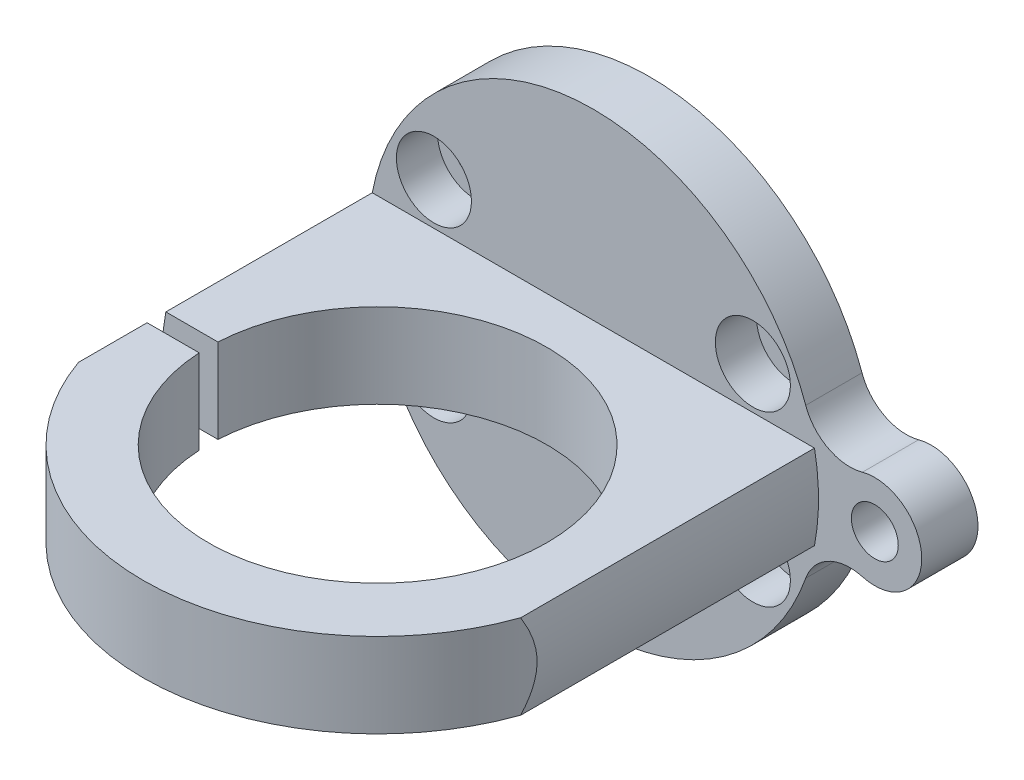
ISO-10303-21;
HEADER;
FILE_DESCRIPTION(('STEP AP214'),'2;1');
FILE_NAME('part.step','',(''),(''),'','','');
FILE_SCHEMA(('AUTOMOTIVE_DESIGN { 1 0 10303 214 1 1 1 1 }'));
ENDSEC;
DATA;
#1=APPLICATION_CONTEXT('core data for automotive mechanical design processes');
#2=APPLICATION_PROTOCOL_DEFINITION('international standard','automotive_design',2000,#1);
#3=PRODUCT_CONTEXT('',#1,'mechanical');
#4=PRODUCT('Part','Part','',(#3));
#5=PRODUCT_RELATED_PRODUCT_CATEGORY('part','',(#4));
#6=PRODUCT_DEFINITION_FORMATION('','',#4);
#7=PRODUCT_DEFINITION_CONTEXT('part definition',#1,'design');
#8=PRODUCT_DEFINITION('design','',#6,#7);
#9=PRODUCT_DEFINITION_SHAPE('','',#8);
#10=(LENGTH_UNIT() NAMED_UNIT(*) SI_UNIT(.MILLI.,.METRE.));
#11=(NAMED_UNIT(*) PLANE_ANGLE_UNIT() SI_UNIT($,.RADIAN.));
#12=(NAMED_UNIT(*) SI_UNIT($,.STERADIAN.) SOLID_ANGLE_UNIT());
#13=UNCERTAINTY_MEASURE_WITH_UNIT(LENGTH_MEASURE(1.E-05),#10,'distance_accuracy_value','');
#14=(GEOMETRIC_REPRESENTATION_CONTEXT(3) GLOBAL_UNCERTAINTY_ASSIGNED_CONTEXT((#13)) GLOBAL_UNIT_ASSIGNED_CONTEXT((#10,
#11,#12)) REPRESENTATION_CONTEXT('',''));
#15=CARTESIAN_POINT('',(0.,0.,0.));
#16=DIRECTION('',(0.,0.,1.));
#17=DIRECTION('',(1.,0.,0.));
#18=AXIS2_PLACEMENT_3D('',#15,#16,#17);
#19=CARTESIAN_POINT('',(0.,0.,-6.));
#20=DIRECTION('',(0.,0.,1.));
#21=DIRECTION('',(1.,0.,0.));
#22=AXIS2_PLACEMENT_3D('',#19,#20,#21);
#23=CYLINDRICAL_SURFACE('',#22,24.);
#24=DIRECTION('',(0.,0.,1.));
#25=VECTOR('',#24,1.);
#26=CARTESIAN_POINT('',(23.5743504682526,-4.5,-6.));
#27=LINE('',#26,#25);
#28=CARTESIAN_POINT('',(23.5743504682526,-4.5,31.3216584885466));
#29=VERTEX_POINT('',#28);
#30=CARTESIAN_POINT('',(23.5743504682526,-4.5,0.));
#31=VERTEX_POINT('',#30);
#32=EDGE_CURVE('E218',#29,#31,#27,.F.);
#33=ORIENTED_EDGE('',*,*,#32,.T.);
#34=CARTESIAN_POINT('',(0.,0.,0.));
#35=DIRECTION('',(0.,0.,1.));
#36=DIRECTION('',(-1.,0.,0.));
#37=AXIS2_PLACEMENT_3D('',#34,#35,#36);
#38=CIRCLE('',#37,24.);
#39=CARTESIAN_POINT('',(23.5743504682526,4.5,0.));
#40=VERTEX_POINT('',#39);
#41=EDGE_CURVE('E160',#31,#40,#38,.T.);
#42=ORIENTED_EDGE('',*,*,#41,.T.);
#43=DIRECTION('',(0.,0.,1.));
#44=VECTOR('',#43,1.);
#45=CARTESIAN_POINT('',(23.5743504682526,4.5,-6.));
#46=LINE('',#45,#44);
#47=CARTESIAN_POINT('',(23.5743504682526,4.5,31.3216584885466));
#48=VERTEX_POINT('',#47);
#49=EDGE_CURVE('E217',#48,#40,#46,.F.);
#50=ORIENTED_EDGE('',*,*,#49,.F.);
#51=CARTESIAN_POINT('',(23.5743504682526,4.5,31.3216584885466));
#52=CARTESIAN_POINT('',(23.6157573192222,4.28301573047034,31.2044104124574));
#53=CARTESIAN_POINT('',(23.6546469507852,4.06307747692704,31.0913980349118));
#54=CARTESIAN_POINT('',(23.7270788362601,3.6162494982413,30.8764465440462));
#55=CARTESIAN_POINT('',(23.7606058100089,3.3893420306107,30.7745393273754));
#56=CARTESIAN_POINT('',(23.8221387533765,2.92591145786183,30.5839248774555));
#57=CARTESIAN_POINT('',(23.8500717825218,2.68930443477932,30.4953953221107));
#58=CARTESIAN_POINT('',(23.8992990807367,2.20942829175013,30.3369201471838));
#59=CARTESIAN_POINT('',(23.9206002093363,1.96616634046176,30.2669553367951));
#60=CARTESIAN_POINT('',(23.9521526056305,1.52702529743059,30.1621717967941));
#61=CARTESIAN_POINT('',(23.9637975166772,1.33228309402099,30.1230239325422));
#62=CARTESIAN_POINT('',(23.9823829053702,0.940112768312964,30.0601979514931));
#63=CARTESIAN_POINT('',(23.9893247646182,0.742685452212207,30.0365152916022));
#64=CARTESIAN_POINT('',(23.9982882648339,0.347726186835377,30.0058846337755));
#65=CARTESIAN_POINT('',(24.0003422165771,0.150203606678098,29.9988267434912));
#66=CARTESIAN_POINT('',(23.9995647437288,-0.244711817262284,30.0014922486172));
#67=CARTESIAN_POINT('',(23.9967334300783,-0.442104663889715,30.0112152629441));
#68=CARTESIAN_POINT('',(23.9862803764371,-0.834761147924739,30.0468922230931));
#69=CARTESIAN_POINT('',(23.9786709585535,-1.03002895178623,30.0728044182715));
#70=CARTESIAN_POINT('',(23.9588737736743,-1.4177874423982,30.1395776867656));
#71=CARTESIAN_POINT('',(23.9466839545981,-1.61027684418988,30.1804454601649));
#72=CARTESIAN_POINT('',(23.9034802076835,-2.18431462097293,30.3234951807389));
#73=CARTESIAN_POINT('',(23.8658903015328,-2.56040118760636,30.4459095987706));
#74=CARTESIAN_POINT('',(23.7872793809115,-3.20017617811185,30.6926830116748));
#75=CARTESIAN_POINT('',(23.7496461115302,-3.46782812056137,30.8083908153243));
#76=CARTESIAN_POINT('',(23.6672030505266,-3.99155750688383,31.0548499962851));
#77=CARTESIAN_POINT('',(23.6224722181626,-4.24772656697199,31.1854318507251));
#78=CARTESIAN_POINT('',(23.5743504682526,-4.5,31.3216584885466));
#79=B_SPLINE_CURVE_WITH_KNOTS('',3,(#51,#52,#53,#54,#55,#56,#57,#58,#59,#60,#61,#62,#63,#64,#65,
#66,#67,#68,#69,#70,#71,#72,#73,#74,#75,#76,#77,#78),.UNSPECIFIED.,.F.,.F.,(4,2,2,2,2,2,2,2,2,2,
2,2,2,4),(0.,0.750439495083586,1.50298057284552,2.26477314161382,3.02577513253489,
3.62211160634237,4.2182728200918,4.81048211830474,5.40267796800572,5.99335285900303,
6.58429269634364,7.77223830948735,8.65367393881817,9.5259146224551),.UNSPECIFIED.);
#80=EDGE_CURVE('E210',#48,#29,#79,.T.);
#81=ORIENTED_EDGE('',*,*,#80,.T.);
#82=EDGE_LOOP('',(#33,#42,#50,#81));
#83=FACE_BOUND('',#82,.T.);
#84=ADVANCED_FACE('F35',(#83),#23,.T.);
#85=CARTESIAN_POINT('',(0.,0.,-6.));
#86=DIRECTION('',(0.,0.,1.));
#87=DIRECTION('',(1.,0.,0.));
#88=AXIS2_PLACEMENT_3D('',#85,#86,#87);
#89=PLANE('',#88);
#90=CARTESIAN_POINT('',(30.,0.,-6.));
#91=DIRECTION('',(0.,0.,1.));
#92=DIRECTION('',(1.,0.,0.));
#93=AXIS2_PLACEMENT_3D('',#90,#91,#92);
#94=CIRCLE('',#93,2.5);
#95=CARTESIAN_POINT('',(32.5,0.,-6.));
#96=VERTEX_POINT('',#95);
#97=EDGE_CURVE('E169',#96,#96,#94,.T.);
#98=ORIENTED_EDGE('',*,*,#97,.T.);
#99=EDGE_LOOP('',(#98));
#100=FACE_BOUND('',#99,.T.);
#101=CARTESIAN_POINT('',(17.,9.,-6.));
#102=DIRECTION('',(0.,0.,1.));
#103=DIRECTION('',(1.,0.,0.));
#104=AXIS2_PLACEMENT_3D('',#101,#102,#103);
#105=CIRCLE('',#104,2.25);
#106=CARTESIAN_POINT('',(19.25,9.,-6.));
#107=VERTEX_POINT('',#106);
#108=EDGE_CURVE('E248',#107,#107,#105,.T.);
#109=ORIENTED_EDGE('',*,*,#108,.T.);
#110=EDGE_LOOP('',(#109));
#111=FACE_BOUND('',#110,.T.);
#112=CARTESIAN_POINT('',(-17.,-9.,-6.));
#113=DIRECTION('',(0.,0.,1.));
#114=DIRECTION('',(1.,0.,0.));
#115=AXIS2_PLACEMENT_3D('',#112,#113,#114);
#116=CIRCLE('',#115,2.25);
#117=CARTESIAN_POINT('',(-14.75,-9.,-6.));
#118=VERTEX_POINT('',#117);
#119=EDGE_CURVE('E260',#118,#118,#116,.T.);
#120=ORIENTED_EDGE('',*,*,#119,.T.);
#121=EDGE_LOOP('',(#120));
#122=FACE_BOUND('',#121,.T.);
#123=CARTESIAN_POINT('',(-17.,9.,-6.));
#124=DIRECTION('',(0.,0.,1.));
#125=DIRECTION('',(1.,0.,0.));
#126=AXIS2_PLACEMENT_3D('',#123,#124,#125);
#127=CIRCLE('',#126,2.25);
#128=CARTESIAN_POINT('',(-14.75,9.,-6.));
#129=VERTEX_POINT('',#128);
#130=EDGE_CURVE('E272',#129,#129,#127,.T.);
#131=ORIENTED_EDGE('',*,*,#130,.T.);
#132=EDGE_LOOP('',(#131));
#133=FACE_BOUND('',#132,.T.);
#134=CARTESIAN_POINT('',(17.,-9.,-6.));
#135=DIRECTION('',(0.,0.,1.));
#136=DIRECTION('',(1.,0.,0.));
#137=AXIS2_PLACEMENT_3D('',#134,#135,#136);
#138=CIRCLE('',#137,2.25);
#139=CARTESIAN_POINT('',(19.25,-9.,-6.));
#140=VERTEX_POINT('',#139);
#141=EDGE_CURVE('E284',#140,#140,#138,.T.);
#142=ORIENTED_EDGE('',*,*,#141,.T.);
#143=EDGE_LOOP('',(#142));
#144=FACE_BOUND('',#143,.T.);
#145=CARTESIAN_POINT('',(0.,0.,-6.));
#146=DIRECTION('',(0.,0.,1.));
#147=DIRECTION('',(1.,0.,0.));
#148=AXIS2_PLACEMENT_3D('',#145,#146,#147);
#149=CIRCLE('',#148,24.);
#150=CARTESIAN_POINT('',(22.6344827586207,7.97998685773998,-6.));
#151=VERTEX_POINT('',#150);
#152=CARTESIAN_POINT('',(22.6344827586207,-7.97998685773998,-6.));
#153=VERTEX_POINT('',#152);
#154=EDGE_CURVE('E314',#151,#153,#149,.T.);
#155=ORIENTED_EDGE('',*,*,#154,.F.);
#156=CARTESIAN_POINT('',(27.35,9.64248411976914,-6.));
#157=DIRECTION('',(0.,0.,1.));
#158=DIRECTION('',(1.,0.,0.));
#159=AXIS2_PLACEMENT_3D('',#156,#157,#158);
#160=CIRCLE('',#159,5.);
#161=CARTESIAN_POINT('',(28.675,4.82124205988457,-6.));
#162=VERTEX_POINT('',#161);
#163=EDGE_CURVE('E167',#151,#162,#160,.T.);
#164=ORIENTED_EDGE('',*,*,#163,.T.);
#165=CARTESIAN_POINT('',(30.,0.,-6.));
#166=DIRECTION('',(0.,0.,-1.));
#167=DIRECTION('',(-1.,0.,0.));
#168=AXIS2_PLACEMENT_3D('',#165,#166,#167);
#169=CIRCLE('',#168,5.);
#170=CARTESIAN_POINT('',(28.675,-4.82124205988457,-6.));
#171=VERTEX_POINT('',#170);
#172=EDGE_CURVE('E145',#162,#171,#169,.T.);
#173=ORIENTED_EDGE('',*,*,#172,.T.);
#174=CARTESIAN_POINT('',(27.35,-9.64248411976914,-6.));
#175=DIRECTION('',(0.,0.,1.));
#176=DIRECTION('',(-1.,0.,0.));
#177=AXIS2_PLACEMENT_3D('',#174,#175,#176);
#178=CIRCLE('',#177,5.);
#179=EDGE_CURVE('E162',#171,#153,#178,.T.);
#180=ORIENTED_EDGE('',*,*,#179,.T.);
#181=EDGE_LOOP('',(#155,#164,#173,#180));
#182=FACE_BOUND('',#181,.T.);
#183=ADVANCED_FACE('F337',(#100,#111,#122,#133,#144,#182),#89,.F.);
#184=CARTESIAN_POINT('',(0.,4.5,24.));
#185=DIRECTION('',(0.,0.,-1.));
#186=DIRECTION('',(-1.,0.,0.));
#187=AXIS2_PLACEMENT_3D('',#184,#185,#186);
#188=PLANE('',#187);
#189=CARTESIAN_POINT('',(-21.5,0.,24.));
#190=DIRECTION('',(0.,0.,-1.));
#191=DIRECTION('',(-1.,0.,0.));
#192=AXIS2_PLACEMENT_3D('',#189,#190,#191);
#193=CIRCLE('',#192,1.69999999999999);
#194=CARTESIAN_POINT('',(-23.2,0.,24.));
#195=VERTEX_POINT('',#194);
#196=EDGE_CURVE('E238',#195,#195,#193,.T.);
#197=ORIENTED_EDGE('',*,*,#196,.F.);
#198=EDGE_LOOP('',(#197));
#199=FACE_BOUND('',#198,.T.);
#200=DIRECTION('',(1.,0.,0.));
#201=VECTOR('',#200,1.);
#202=CARTESIAN_POINT('',(0.,-4.5,24.));
#203=LINE('',#202,#201);
#204=CARTESIAN_POINT('',(-23.5743504682526,-4.5,24.));
#205=VERTEX_POINT('',#204);
#206=CARTESIAN_POINT('',(-18.0222778804456,-4.5,24.));
#207=VERTEX_POINT('',#206);
#208=EDGE_CURVE('E287',#205,#207,#203,.T.);
#209=ORIENTED_EDGE('',*,*,#208,.F.);
#210=CARTESIAN_POINT('',(0.,0.,24.));
#211=DIRECTION('',(0.,0.,-1.));
#212=DIRECTION('',(-1.,0.,0.));
#213=AXIS2_PLACEMENT_3D('',#210,#211,#212);
#214=CIRCLE('',#213,24.);
#215=CARTESIAN_POINT('',(-23.5743504682526,4.5,24.));
#216=VERTEX_POINT('',#215);
#217=EDGE_CURVE('E340',#205,#216,#214,.T.);
#218=ORIENTED_EDGE('',*,*,#217,.T.);
#219=DIRECTION('',(1.,0.,0.));
#220=VECTOR('',#219,1.);
#221=CARTESIAN_POINT('',(0.,4.5,24.));
#222=LINE('',#221,#220);
#223=CARTESIAN_POINT('',(-18.0222778804456,4.5,24.));
#224=VERTEX_POINT('',#223);
#225=EDGE_CURVE('E297',#216,#224,#222,.T.);
#226=ORIENTED_EDGE('',*,*,#225,.T.);
#227=DIRECTION('',(0.,-1.,0.));
#228=VECTOR('',#227,1.);
#229=CARTESIAN_POINT('',(-18.0222778804456,4.5,24.));
#230=LINE('',#229,#228);
#231=EDGE_CURVE('E307',#224,#207,#230,.T.);
#232=ORIENTED_EDGE('',*,*,#231,.T.);
#233=EDGE_LOOP('',(#209,#218,#226,#232));
#234=FACE_BOUND('',#233,.T.);
#235=ADVANCED_FACE('F194',(#199,#234),#188,.T.);
#236=CARTESIAN_POINT('',(0.,4.5,23.));
#237=DIRECTION('',(0.,-1.,0.));
#238=DIRECTION('',(0.,0.,-1.));
#239=AXIS2_PLACEMENT_3D('',#236,#237,#238);
#240=CYLINDRICAL_SURFACE('',#239,25.);
#241=ORIENTED_EDGE('',*,*,#80,.F.);
#242=CARTESIAN_POINT('',(0.,4.5,23.));
#243=DIRECTION('',(0.,1.,0.));
#244=DIRECTION('',(0.,0.,1.));
#245=AXIS2_PLACEMENT_3D('',#242,#243,#244);
#246=CIRCLE('',#245,25.);
#247=CARTESIAN_POINT('',(-23.5743504682526,4.5,31.3216584885466));
#248=VERTEX_POINT('',#247);
#249=EDGE_CURVE('E299',#248,#48,#246,.T.);
#250=ORIENTED_EDGE('',*,*,#249,.F.);
#251=CARTESIAN_POINT('',(-23.5743504682526,-4.5,31.3216584885466));
#252=CARTESIAN_POINT('',(-23.6157573192222,-4.28301573047034,31.2044104124574));
#253=CARTESIAN_POINT('',(-23.6546469507852,-4.06307747692704,31.0913980349118));
#254=CARTESIAN_POINT('',(-23.7270788362601,-3.6162494982413,30.8764465440462));
#255=CARTESIAN_POINT('',(-23.7606058100089,-3.3893420306107,30.7745393273754));
#256=CARTESIAN_POINT('',(-23.8221387533765,-2.92591145786183,30.5839248774555));
#257=CARTESIAN_POINT('',(-23.8500717825218,-2.68930443477932,30.4953953221107));
#258=CARTESIAN_POINT('',(-23.8992990807367,-2.20942829175013,30.3369201471838));
#259=CARTESIAN_POINT('',(-23.9206002093363,-1.96616634046176,30.2669553367951));
#260=CARTESIAN_POINT('',(-23.9521526056305,-1.52702529743059,30.1621717967941));
#261=CARTESIAN_POINT('',(-23.9637975166772,-1.33228309402099,30.1230239325422));
#262=CARTESIAN_POINT('',(-23.9823829053702,-0.940112768312964,30.0601979514931));
#263=CARTESIAN_POINT('',(-23.9893247646182,-0.742685452212207,30.0365152916022));
#264=CARTESIAN_POINT('',(-23.9982882648339,-0.347726186835377,30.0058846337755));
#265=CARTESIAN_POINT('',(-24.0003422165771,-0.150203606678098,29.9988267434912));
#266=CARTESIAN_POINT('',(-23.9995647437288,0.244711817262284,30.0014922486172));
#267=CARTESIAN_POINT('',(-23.9967334300783,0.442104663889715,30.0112152629441));
#268=CARTESIAN_POINT('',(-23.9862803764371,0.834761147924739,30.0468922230931));
#269=CARTESIAN_POINT('',(-23.9786709585535,1.03002895178623,30.0728044182715));
#270=CARTESIAN_POINT('',(-23.9588737736743,1.4177874423982,30.1395776867656));
#271=CARTESIAN_POINT('',(-23.9466839545981,1.61027684418988,30.1804454601649));
#272=CARTESIAN_POINT('',(-23.9034802076835,2.18431462097293,30.3234951807389));
#273=CARTESIAN_POINT('',(-23.8658903015328,2.56040118760636,30.4459095987706));
#274=CARTESIAN_POINT('',(-23.7872793809115,3.20017617811185,30.6926830116748));
#275=CARTESIAN_POINT('',(-23.7496461115302,3.46782812056137,30.8083908153243));
#276=CARTESIAN_POINT('',(-23.6672030505266,3.99155750688383,31.0548499962851));
#277=CARTESIAN_POINT('',(-23.6224722181626,4.24772656697199,31.1854318507251));
#278=CARTESIAN_POINT('',(-23.5743504682526,4.5,31.3216584885466));
#279=B_SPLINE_CURVE_WITH_KNOTS('',3,(#251,#252,#253,#254,#255,#256,#257,#258,#259,#260,#261,
#262,#263,#264,#265,#266,#267,#268,#269,#270,#271,#272,#273,#274,#275,#276,#277,#278),
.UNSPECIFIED.,.F.,.F.,(4,2,2,2,2,2,2,2,2,2,2,2,2,4),(0.,0.750439495083586,1.50298057284552,
2.26477314161382,3.02577513253489,3.62211160634237,4.2182728200918,4.81048211830474,
5.40267796800572,5.99335285900303,6.58429269634364,7.77223830948735,8.65367393881817,
9.5259146224551),.UNSPECIFIED.);
#280=CARTESIAN_POINT('',(-23.8997093023256,2.1917790181339,30.335113854899));
#281=VERTEX_POINT('',#280);
#282=EDGE_CURVE('E186',#281,#248,#279,.T.);
#283=ORIENTED_EDGE('',*,*,#282,.F.);
#284=CARTESIAN_POINT('',(-24.3647286050963,1.53487133634801,28.6));
#285=CARTESIAN_POINT('',(-24.3385334363902,1.58373798265813,28.7139775703707));
#286=CARTESIAN_POINT('',(-24.3114208287813,1.63136154234516,28.8282706371185));
#287=CARTESIAN_POINT('',(-24.2553668314557,1.72436120298112,29.0573145974324));
#288=CARTESIAN_POINT('',(-24.2264255470778,1.76973743311678,29.1720654642713));
#289=CARTESIAN_POINT('',(-24.1667192479999,1.85848378673641,29.4018574256571));
#290=CARTESIAN_POINT('',(-24.1359543539079,1.90185404255247,29.5168985005297));
#291=CARTESIAN_POINT('',(-24.0725976603706,1.98671714979433,29.7471699811742));
#292=CARTESIAN_POINT('',(-24.0400058270598,2.02820996639259,29.8624003904173));
#293=CARTESIAN_POINT('',(-23.9393100191523,2.15021375507858,30.2088397530666));
#294=CARTESIAN_POINT('',(-23.8684386531629,2.22802365182075,30.4402071163822));
#295=CARTESIAN_POINT('',(-23.7192892753877,2.37662100906926,30.9028092297959));
#296=CARTESIAN_POINT('',(-23.6410110560834,2.44740827270812,31.1340439759957));
#297=CARTESIAN_POINT('',(-23.4766649904604,2.5819797772045,31.5969035437314));
#298=CARTESIAN_POINT('',(-23.3905674025857,2.64573504711592,31.8285262592054));
#299=CARTESIAN_POINT('',(-23.2107968478142,2.76538087649977,32.2908790842952));
#300=CARTESIAN_POINT('',(-23.1171236246241,2.82127116971447,32.5216091634351));
#301=CARTESIAN_POINT('',(-22.9222892745375,2.92433317144847,32.9815305834762));
#302=CARTESIAN_POINT('',(-22.821137047292,2.97151501598587,33.2107234102247));
#303=CARTESIAN_POINT('',(-22.6112750435608,3.05620191689344,33.6673974729581));
#304=CARTESIAN_POINT('',(-22.5025667300751,3.0937088399212,33.8948790308764));
#305=CARTESIAN_POINT('',(-22.2927129469009,3.15346785906082,34.3173712534795));
#306=CARTESIAN_POINT('',(-22.1925030920029,3.17708991961985,34.5126522286489));
#307=CARTESIAN_POINT('',(-21.986579255437,3.21507441060415,34.9012044152304));
#308=CARTESIAN_POINT('',(-21.8808656745912,3.22943751431862,35.0944757717714));
#309=CARTESIAN_POINT('',(-21.6639482278379,3.24768976941905,35.478867149361));
#310=CARTESIAN_POINT('',(-21.552735448731,3.25156130884696,35.6699830172825));
#311=CARTESIAN_POINT('',(-21.3253237949323,3.24729477918506,36.0491156352255));
#312=CARTESIAN_POINT('',(-21.2091250542498,3.23915703267695,36.2371324683531));
#313=CARTESIAN_POINT('',(-20.9706323710269,3.20888181418307,36.6118539648462));
#314=CARTESIAN_POINT('',(-20.8482762034527,3.18655154658656,36.7985041706439));
#315=CARTESIAN_POINT('',(-20.5998218237209,3.12546875389362,37.1667451562976));
#316=CARTESIAN_POINT('',(-20.4737221190001,3.08670959448353,37.3483338606121));
#317=CARTESIAN_POINT('',(-20.219847768322,2.99032755726669,37.7039185686807));
#318=CARTESIAN_POINT('',(-20.0920844824312,2.93279886855754,37.8779476659678));
#319=CARTESIAN_POINT('',(-19.8365587552973,2.79579324959464,38.2169597016321));
#320=CARTESIAN_POINT('',(-19.7087965386287,2.71634559253682,38.381954355899));
#321=CARTESIAN_POINT('',(-19.4707375805368,2.54239559939889,38.6819254867493));
#322=CARTESIAN_POINT('',(-19.3601003054575,2.45061373289908,38.8181861350708));
#323=CARTESIAN_POINT('',(-19.1447290497027,2.24443056248103,39.0781791172158));
#324=CARTESIAN_POINT('',(-19.0400001864018,2.13001002593505,39.2019006623855));
#325=CARTESIAN_POINT('',(-18.8402006813346,1.8746945239978,39.4338218573584));
#326=CARTESIAN_POINT('',(-18.7452734361951,1.73347446134265,39.541798600837));
#327=CARTESIAN_POINT('',(-18.6170173774416,1.50287830073305,39.6856482064051));
#328=CARTESIAN_POINT('',(-18.5766455355931,1.42295054418319,39.7305525833018));
#329=CARTESIAN_POINT('',(-18.5015965299608,1.25712090476786,39.8135074774243));
#330=CARTESIAN_POINT('',(-18.4669159121219,1.17122269083133,39.8515621531637));
#331=CARTESIAN_POINT('',(-18.3942550179231,0.965520323854969,39.9308935091991));
#332=CARTESIAN_POINT('',(-18.3587822838977,0.843675800458655,39.9692908576954));
#333=CARTESIAN_POINT('',(-18.3019791685359,0.593006022268458,40.0305410496288));
#334=CARTESIAN_POINT('',(-18.2806393433245,0.464185491365228,40.0534042735246));
#335=CARTESIAN_POINT('',(-18.2536441101458,0.202530080266468,40.0822974575331));
#336=CARTESIAN_POINT('',(-18.2480455110572,0.0696824045964489,40.0882664481666));
#337=CARTESIAN_POINT('',(-18.2531690358145,-0.195331257372771,40.0827934798375));
#338=CARTESIAN_POINT('',(-18.2638911262661,-0.327497245066233,40.0713515564998));
#339=CARTESIAN_POINT('',(-18.2997857819516,-0.580132104902831,40.0328642597361));
#340=CARTESIAN_POINT('',(-18.3241618952024,-0.700849601779827,40.0066785041519));
#341=CARTESIAN_POINT('',(-18.3851161235766,-0.935248491520648,39.9407648066543));
#342=CARTESIAN_POINT('',(-18.4216981858215,-1.04892759421413,39.9010324840036));
#343=CARTESIAN_POINT('',(-18.5185059703771,-1.30272916467186,39.7949863923354));
#344=CARTESIAN_POINT('',(-18.5825520222421,-1.43954007428014,39.7242321919334));
#345=CARTESIAN_POINT('',(-18.7236124047489,-1.69578077295666,39.5661582525348));
#346=CARTESIAN_POINT('',(-18.8006497915181,-1.81517894395756,39.4788090263122));
#347=CARTESIAN_POINT('',(-18.9953384875816,-2.07983857709831,39.2544388639999));
#348=CARTESIAN_POINT('',(-19.1170799216749,-2.21691640392302,39.1113620720405));
#349=CARTESIAN_POINT('',(-19.3690111733188,-2.4601154277705,38.8076102312752));
#350=CARTESIAN_POINT('',(-19.4992153608496,-2.56618219489933,38.646904912899));
#351=CARTESIAN_POINT('',(-19.7335849742352,-2.730937026152,38.34969951951));
#352=CARTESIAN_POINT('',(-19.8372004770122,-2.79491417987831,38.2156175401911));
#353=CARTESIAN_POINT('',(-20.0445365991255,-2.90828109538358,37.941422231395));
#354=CARTESIAN_POINT('',(-20.1482572448508,-2.95766269223846,37.8013055760706));
#355=CARTESIAN_POINT('',(-20.3546270658332,-3.04353829165821,37.516203912168));
#356=CARTESIAN_POINT('',(-20.4572748279482,-3.08001697477782,37.3712133389154));
#357=CARTESIAN_POINT('',(-20.6605532356314,-3.14151248328639,37.0774107993677));
#358=CARTESIAN_POINT('',(-20.7611831588867,-3.1665252719486,36.9285975066736));
#359=CARTESIAN_POINT('',(-21.028557998876,-3.22019759688432,36.5237790991229));
#360=CARTESIAN_POINT('',(-21.1928507388584,-3.23939631071066,36.2648797746961));
#361=CARTESIAN_POINT('',(-21.5120712122413,-3.25390246186473,35.7406896555651));
#362=CARTESIAN_POINT('',(-21.6669925796892,-3.2491938393868,35.4753946836683));
#363=CARTESIAN_POINT('',(-21.9671387732237,-3.21979972896844,34.9389982614785));
#364=CARTESIAN_POINT('',(-22.112318111876,-3.19502675241949,34.667876454317));
#365=CARTESIAN_POINT('',(-22.3917540168518,-3.12856139434019,34.1221995428851));
#366=CARTESIAN_POINT('',(-22.526012031066,-3.086871259999,33.8476448993079));
#367=CARTESIAN_POINT('',(-22.7510189197817,-3.00134194138837,33.3654720794811));
#368=CARTESIAN_POINT('',(-22.8442094432717,-2.96068867437376,33.1584115686668));
#369=CARTESIAN_POINT('',(-23.024388493418,-2.87207618281287,32.743139208142));
#370=CARTESIAN_POINT('',(-23.1113765268117,-2.82411637815202,32.534927268278));
#371=CARTESIAN_POINT('',(-23.2792010830456,-2.7215110412464,32.1175339378097));
#372=CARTESIAN_POINT('',(-23.3600339983459,-2.66686163638435,31.9083520537561));
#373=CARTESIAN_POINT('',(-23.5155247712785,-2.55137985140135,31.4894061361882));
#374=CARTESIAN_POINT('',(-23.5901826653635,-2.49054750778444,31.279642106118));
#375=CARTESIAN_POINT('',(-23.7321613905875,-2.3640734265739,30.8633367699531));
#376=CARTESIAN_POINT('',(-23.7995843907902,-2.29852962468513,30.6568005083532));
#377=CARTESIAN_POINT('',(-23.9285360851068,-2.1618377105549,30.2437537041032));
#378=CARTESIAN_POINT('',(-23.9900650030512,-2.09068981131872,30.037243160774));
#379=CARTESIAN_POINT('',(-24.1071806583825,-1.94268181233978,29.6249294307223));
#380=CARTESIAN_POINT('',(-24.1627757554613,-1.86583001442275,29.419125655013));
#381=CARTESIAN_POINT('',(-24.241792273872,-1.7456720180906,29.1111980682059));
#382=CARTESIAN_POINT('',(-24.2674032519795,-1.70480320842436,29.0086787079431));
#383=CARTESIAN_POINT('',(-24.3171633892363,-1.62124781990399,28.8040214190092));
#384=CARTESIAN_POINT('',(-24.3413124792158,-1.57856115519978,28.7018835086008));
#385=CARTESIAN_POINT('',(-24.3647286050963,-1.53487133634801,28.6));
#386=B_SPLINE_CURVE_WITH_KNOTS('',3,(#284,#285,#286,#287,#288,#289,#290,#291,#292,#293,#294,
#295,#296,#297,#298,#299,#300,#301,#302,#303,#304,#305,#306,#307,#308,#309,#310,#311,#312,#313,
#314,#315,#316,#317,#318,#319,#320,#321,#322,#323,#324,#325,#326,#327,#328,#329,#330,#331,#332,
#333,#334,#335,#336,#337,#338,#339,#340,#341,#342,#343,#344,#345,#346,#347,#348,#349,#350,#351,
#352,#353,#354,#355,#356,#357,#358,#359,#360,#361,#362,#363,#364,#365,#366,#367,#368,#369,#370,
#371,#372,#373,#374,#375,#376,#377,#378,#379,#380,#381,#382,#383,#384,#385),.UNSPECIFIED.,.F.,
.F.,(4,2,2,2,2,2,2,2,2,2,2,2,2,2,2,2,2,2,2,2,2,2,2,2,2,2,2,2,2,2,2,2,2,2,2,2,2,2,2,2,2,2,2,2,2,
2,2,2,2,2,4),(0.,0.38022499631615,0.760428110139757,1.14060610646842,1.52079115241887,
2.28310961627768,3.04544944439374,3.81082112981607,4.57621871959162,5.34071974407243,
6.1050731569332,6.76710712814685,7.42909295240097,8.09218935131156,8.75526793909981,
9.42755232962323,10.100108460999,10.7693401919576,11.4376824420786,12.0304043876406,
12.6236320577199,13.2245784220342,13.5246129919435,13.8244647892915,14.2204615448881,
14.6161934203134,15.0133516398425,15.4105090467383,15.7866054295484,16.1628235512944,
16.6605019664194,17.1590731057889,17.8528988804507,18.5479352303284,19.0905863590734,
19.6335404810961,20.1771370978864,20.7209249486776,21.6411306934085,22.5619546701194,
23.4868155635096,24.4115536432807,25.1033828725627,25.7952670594179,26.4875536900422,
27.1798362336454,27.8604916059669,28.5411211198357,29.2207787270052,29.5606508669504,
29.900539075547),.UNSPECIFIED.);
#387=CARTESIAN_POINT('',(-23.8997093023256,-2.1917790181339,30.335113854899));
#388=VERTEX_POINT('',#387);
#389=EDGE_CURVE('E201',#281,#388,#386,.T.);
#390=ORIENTED_EDGE('',*,*,#389,.T.);
#391=CARTESIAN_POINT('',(-23.5743504682526,-4.5,31.3216584885466));
#392=VERTEX_POINT('',#391);
#393=EDGE_CURVE('E59',#392,#388,#279,.T.);
#394=ORIENTED_EDGE('',*,*,#393,.F.);
#395=CARTESIAN_POINT('',(0.,-4.5,23.));
#396=DIRECTION('',(0.,1.,0.));
#397=DIRECTION('',(0.,0.,1.));
#398=AXIS2_PLACEMENT_3D('',#395,#396,#397);
#399=CIRCLE('',#398,25.);
#400=EDGE_CURVE('E289',#392,#29,#399,.T.);
#401=ORIENTED_EDGE('',*,*,#400,.T.);
#402=EDGE_LOOP('',(#241,#250,#283,#390,#394,#401));
#403=FACE_BOUND('',#402,.T.);
#404=ADVANCED_FACE('F188',(#403),#240,.T.);
#405=CARTESIAN_POINT('',(0.,4.5,22.));
#406=DIRECTION('',(0.,0.,-1.));
#407=DIRECTION('',(-1.,0.,0.));
#408=AXIS2_PLACEMENT_3D('',#405,#406,#407);
#409=PLANE('',#408);
#410=CARTESIAN_POINT('',(-21.5,0.,22.));
#411=DIRECTION('',(0.,0.,1.));
#412=DIRECTION('',(1.,0.,0.));
#413=AXIS2_PLACEMENT_3D('',#410,#411,#412);
#414=CIRCLE('',#413,1.25);
#415=CARTESIAN_POINT('',(-20.25,0.,22.));
#416=VERTEX_POINT('',#415);
#417=EDGE_CURVE('E226',#416,#416,#414,.T.);
#418=ORIENTED_EDGE('',*,*,#417,.F.);
#419=EDGE_LOOP('',(#418));
#420=FACE_BOUND('',#419,.T.);
#421=CARTESIAN_POINT('',(0.,0.,22.));
#422=DIRECTION('',(0.,0.,-1.));
#423=DIRECTION('',(-1.,0.,0.));
#424=AXIS2_PLACEMENT_3D('',#421,#422,#423);
#425=CIRCLE('',#424,24.);
#426=CARTESIAN_POINT('',(-23.5743504682526,-4.5,22.));
#427=VERTEX_POINT('',#426);
#428=CARTESIAN_POINT('',(-23.5743504682526,4.5,22.));
#429=VERTEX_POINT('',#428);
#430=EDGE_CURVE('E223',#427,#429,#425,.T.);
#431=ORIENTED_EDGE('',*,*,#430,.F.);
#432=DIRECTION('',(1.,0.,0.));
#433=VECTOR('',#432,1.);
#434=CARTESIAN_POINT('',(0.,-4.5,22.));
#435=LINE('',#434,#433);
#436=CARTESIAN_POINT('',(-18.0222778804456,-4.5,22.));
#437=VERTEX_POINT('',#436);
#438=EDGE_CURVE('E292',#427,#437,#435,.T.);
#439=ORIENTED_EDGE('',*,*,#438,.T.);
#440=DIRECTION('',(0.,-1.,0.));
#441=VECTOR('',#440,1.);
#442=CARTESIAN_POINT('',(-18.0222778804456,4.5,22.));
#443=LINE('',#442,#441);
#444=CARTESIAN_POINT('',(-18.0222778804456,4.5,22.));
#445=VERTEX_POINT('',#444);
#446=EDGE_CURVE('E310',#445,#437,#443,.T.);
#447=ORIENTED_EDGE('',*,*,#446,.F.);
#448=DIRECTION('',(1.,0.,0.));
#449=VECTOR('',#448,1.);
#450=CARTESIAN_POINT('',(0.,4.5,22.));
#451=LINE('',#450,#449);
#452=EDGE_CURVE('E302',#429,#445,#451,.T.);
#453=ORIENTED_EDGE('',*,*,#452,.F.);
#454=EDGE_LOOP('',(#431,#439,#447,#453));
#455=FACE_BOUND('',#454,.T.);
#456=ADVANCED_FACE('F193',(#420,#455),#409,.F.);
#457=CARTESIAN_POINT('',(0.,4.5,0.));
#458=DIRECTION('',(0.,1.,0.));
#459=DIRECTION('',(0.,0.,1.));
#460=AXIS2_PLACEMENT_3D('',#457,#458,#459);
#461=PLANE('',#460);
#462=DIRECTION('',(-1.,0.,0.));
#463=VECTOR('',#462,1.);
#464=CARTESIAN_POINT('',(0.,4.5,0.));
#465=LINE('',#464,#463);
#466=CARTESIAN_POINT('',(-23.5743504682526,4.5,0.));
#467=VERTEX_POINT('',#466);
#468=EDGE_CURVE('E321',#40,#467,#465,.T.);
#469=ORIENTED_EDGE('',*,*,#468,.T.);
#470=DIRECTION('',(0.,0.,1.));
#471=VECTOR('',#470,1.);
#472=CARTESIAN_POINT('',(-23.5743504682526,4.5,-6.));
#473=LINE('',#472,#471);
#474=EDGE_CURVE('E222',#467,#429,#473,.T.);
#475=ORIENTED_EDGE('',*,*,#474,.T.);
#476=ORIENTED_EDGE('',*,*,#452,.T.);
#477=CARTESIAN_POINT('',(0.,4.5,23.));
#478=DIRECTION('',(0.,1.,0.));
#479=DIRECTION('',(0.,0.,1.));
#480=AXIS2_PLACEMENT_3D('',#477,#478,#479);
#481=CIRCLE('',#480,18.05);
#482=EDGE_CURVE('E304',#224,#445,#481,.T.);
#483=ORIENTED_EDGE('',*,*,#482,.F.);
#484=ORIENTED_EDGE('',*,*,#225,.F.);
#485=EDGE_CURVE('E361',#216,#248,#473,.T.);
#486=ORIENTED_EDGE('',*,*,#485,.T.);
#487=ORIENTED_EDGE('',*,*,#249,.T.);
#488=ORIENTED_EDGE('',*,*,#49,.T.);
#489=EDGE_LOOP('',(#469,#475,#476,#483,#484,#486,#487,#488));
#490=FACE_BOUND('',#489,.T.);
#491=ADVANCED_FACE('F360',(#490),#461,.T.);
#492=CARTESIAN_POINT('',(0.,-4.5,0.));
#493=DIRECTION('',(0.,1.,0.));
#494=DIRECTION('',(0.,0.,1.));
#495=AXIS2_PLACEMENT_3D('',#492,#493,#494);
#496=PLANE('',#495);
#497=DIRECTION('',(0.,0.,1.));
#498=VECTOR('',#497,1.);
#499=CARTESIAN_POINT('',(-23.5743504682526,-4.5,-6.));
#500=LINE('',#499,#498);
#501=CARTESIAN_POINT('',(-23.5743504682526,-4.5,0.));
#502=VERTEX_POINT('',#501);
#503=EDGE_CURVE('E225',#502,#427,#500,.T.);
#504=ORIENTED_EDGE('',*,*,#503,.F.);
#505=DIRECTION('',(-1.,0.,0.));
#506=VECTOR('',#505,1.);
#507=CARTESIAN_POINT('',(0.,-4.5,0.));
#508=LINE('',#507,#506);
#509=EDGE_CURVE('E317',#31,#502,#508,.T.);
#510=ORIENTED_EDGE('',*,*,#509,.F.);
#511=ORIENTED_EDGE('',*,*,#32,.F.);
#512=ORIENTED_EDGE('',*,*,#400,.F.);
#513=EDGE_CURVE('E185',#205,#392,#500,.T.);
#514=ORIENTED_EDGE('',*,*,#513,.F.);
#515=ORIENTED_EDGE('',*,*,#208,.T.);
#516=CARTESIAN_POINT('',(0.,-4.5,23.));
#517=DIRECTION('',(0.,1.,0.));
#518=DIRECTION('',(0.,0.,1.));
#519=AXIS2_PLACEMENT_3D('',#516,#517,#518);
#520=CIRCLE('',#519,18.05);
#521=EDGE_CURVE('E294',#207,#437,#520,.T.);
#522=ORIENTED_EDGE('',*,*,#521,.T.);
#523=ORIENTED_EDGE('',*,*,#438,.F.);
#524=EDGE_LOOP('',(#504,#510,#511,#512,#514,#515,#522,#523));
#525=FACE_BOUND('',#524,.T.);
#526=ADVANCED_FACE('F346',(#525),#496,.F.);
#527=CARTESIAN_POINT('',(-19.8,0.,28.6));
#528=DIRECTION('',(0.,0.,-1.));
#529=DIRECTION('',(-1.,0.,0.));
#530=AXIS2_PLACEMENT_3D('',#527,#528,#529);
#531=PLANE('',#530);
#532=CARTESIAN_POINT('',(-21.5,0.,28.6));
#533=DIRECTION('',(0.,0.,1.));
#534=DIRECTION('',(1.,0.,0.));
#535=AXIS2_PLACEMENT_3D('',#532,#533,#534);
#536=CIRCLE('',#535,1.7);
#537=CARTESIAN_POINT('',(-19.8,0.,28.6));
#538=VERTEX_POINT('',#537);
#539=EDGE_CURVE('E235',#538,#538,#536,.T.);
#540=ORIENTED_EDGE('',*,*,#539,.F.);
#541=EDGE_LOOP('',(#540));
#542=FACE_BOUND('',#541,.T.);
#543=CARTESIAN_POINT('',(0.,0.,28.6));
#544=DIRECTION('',(0.,0.,-1.));
#545=DIRECTION('',(-1.,0.,0.));
#546=AXIS2_PLACEMENT_3D('',#543,#544,#545);
#547=CIRCLE('',#546,24.);
#548=CARTESIAN_POINT('',(-23.8997093023256,-2.1917790181339,28.6));
#549=VERTEX_POINT('',#548);
#550=CARTESIAN_POINT('',(-23.8997093023256,2.1917790181339,28.6));
#551=VERTEX_POINT('',#550);
#552=EDGE_CURVE('E175',#549,#551,#547,.T.);
#553=ORIENTED_EDGE('',*,*,#552,.F.);
#554=CARTESIAN_POINT('',(-21.5,0.,28.6));
#555=DIRECTION('',(0.,0.,1.));
#556=DIRECTION('',(1.,0.,0.));
#557=AXIS2_PLACEMENT_3D('',#554,#555,#556);
#558=CIRCLE('',#557,3.25);
#559=EDGE_CURVE('E232',#549,#551,#558,.T.);
#560=ORIENTED_EDGE('',*,*,#559,.T.);
#561=EDGE_LOOP('',(#553,#560));
#562=FACE_BOUND('',#561,.T.);
#563=ADVANCED_FACE('F395',(#542,#562),#531,.F.);
#564=CARTESIAN_POINT('',(-21.5,0.,44.));
#565=DIRECTION('',(0.,0.,1.));
#566=DIRECTION('',(1.,0.,0.));
#567=AXIS2_PLACEMENT_3D('',#564,#565,#566);
#568=CYLINDRICAL_SURFACE('',#567,3.25);
#569=DIRECTION('',(0.,0.,1.));
#570=VECTOR('',#569,1.);
#571=CARTESIAN_POINT('',(-23.8997093023256,2.1917790181339,21.));
#572=LINE('',#571,#570);
#573=EDGE_CURVE('E12',#551,#281,#572,.T.);
#574=ORIENTED_EDGE('',*,*,#573,.F.);
#575=ORIENTED_EDGE('',*,*,#559,.F.);
#576=DIRECTION('',(0.,0.,1.));
#577=VECTOR('',#576,1.);
#578=CARTESIAN_POINT('',(-23.8997093023256,-2.1917790181339,21.));
#579=LINE('',#578,#577);
#580=EDGE_CURVE('E44',#388,#549,#579,.F.);
#581=ORIENTED_EDGE('',*,*,#580,.F.);
#582=ORIENTED_EDGE('',*,*,#389,.F.);
#583=EDGE_LOOP('',(#574,#575,#581,#582));
#584=FACE_BOUND('',#583,.T.);
#585=ADVANCED_FACE('F388',(#584),#568,.F.);
#586=DIRECTION('',(0.,0.,-1.));
#587=VECTOR('',#586,1.);
#588=CARTESIAN_POINT('',(22.6344827586207,-7.97998685773998,0.));
#589=LINE('',#588,#587);
#590=CARTESIAN_POINT('',(22.6344827586207,-7.97998685773998,0.));
#591=VERTEX_POINT('',#590);
#592=EDGE_CURVE('E173',#591,#153,#589,.T.);
#593=ORIENTED_EDGE('',*,*,#592,.F.);
#594=CARTESIAN_POINT('',(0.,0.,0.));
#595=DIRECTION('',(0.,0.,1.));
#596=DIRECTION('',(1.,0.,0.));
#597=AXIS2_PLACEMENT_3D('',#594,#595,#596);
#598=CIRCLE('',#597,24.);
#599=EDGE_CURVE('E313',#502,#591,#598,.T.);
#600=ORIENTED_EDGE('',*,*,#599,.F.);
#601=ORIENTED_EDGE('',*,*,#503,.T.);
#602=ORIENTED_EDGE('',*,*,#430,.T.);
#603=ORIENTED_EDGE('',*,*,#474,.F.);
#604=CARTESIAN_POINT('',(22.6344827586207,7.97998685773998,0.));
#605=VERTEX_POINT('',#604);
#606=EDGE_CURVE('E318',#605,#467,#598,.T.);
#607=ORIENTED_EDGE('',*,*,#606,.F.);
#608=DIRECTION('',(0.,0.,-1.));
#609=VECTOR('',#608,1.);
#610=CARTESIAN_POINT('',(22.6344827586207,7.97998685773998,0.));
#611=LINE('',#610,#609);
#612=EDGE_CURVE('E149',#605,#151,#611,.T.);
#613=ORIENTED_EDGE('',*,*,#612,.T.);
#614=ORIENTED_EDGE('',*,*,#154,.T.);
#615=EDGE_LOOP('',(#593,#600,#601,#602,#603,#607,#613,#614));
#616=FACE_BOUND('',#615,.T.);
#617=ADVANCED_FACE('F37',(#616),#23,.T.);
#618=CARTESIAN_POINT('',(0.,0.,0.));
#619=DIRECTION('',(0.,0.,1.));
#620=DIRECTION('',(1.,0.,0.));
#621=AXIS2_PLACEMENT_3D('',#618,#619,#620);
#622=PLANE('',#621);
#623=CARTESIAN_POINT('',(30.,0.,0.));
#624=DIRECTION('',(0.,0.,1.));
#625=DIRECTION('',(1.,0.,0.));
#626=AXIS2_PLACEMENT_3D('',#623,#624,#625);
#627=CIRCLE('',#626,2.5);
#628=CARTESIAN_POINT('',(32.5,0.,0.));
#629=VERTEX_POINT('',#628);
#630=EDGE_CURVE('E612',#629,#629,#627,.T.);
#631=ORIENTED_EDGE('',*,*,#630,.F.);
#632=EDGE_LOOP('',(#631));
#633=FACE_BOUND('',#632,.T.);
#634=CARTESIAN_POINT('',(17.,9.,0.));
#635=DIRECTION('',(0.,0.,1.));
#636=DIRECTION('',(1.,0.,0.));
#637=AXIS2_PLACEMENT_3D('',#634,#635,#636);
#638=CIRCLE('',#637,4.);
#639=CARTESIAN_POINT('',(21.,9.,0.));
#640=VERTEX_POINT('',#639);
#641=EDGE_CURVE('E239',#640,#640,#638,.T.);
#642=ORIENTED_EDGE('',*,*,#641,.F.);
#643=EDGE_LOOP('',(#642));
#644=FACE_BOUND('',#643,.T.);
#645=CARTESIAN_POINT('',(-17.,9.,0.));
#646=DIRECTION('',(0.,0.,1.));
#647=DIRECTION('',(1.,0.,0.));
#648=AXIS2_PLACEMENT_3D('',#645,#646,#647);
#649=CIRCLE('',#648,4.);
#650=CARTESIAN_POINT('',(-13.,9.,0.));
#651=VERTEX_POINT('',#650);
#652=EDGE_CURVE('E263',#651,#651,#649,.T.);
#653=ORIENTED_EDGE('',*,*,#652,.F.);
#654=EDGE_LOOP('',(#653));
#655=FACE_BOUND('',#654,.T.);
#656=ORIENTED_EDGE('',*,*,#468,.F.);
#657=ORIENTED_EDGE('',*,*,#41,.F.);
#658=ORIENTED_EDGE('',*,*,#509,.T.);
#659=ORIENTED_EDGE('',*,*,#599,.T.);
#660=CARTESIAN_POINT('',(27.35,-9.64248411976914,0.));
#661=DIRECTION('',(0.,0.,1.));
#662=DIRECTION('',(-1.,0.,0.));
#663=AXIS2_PLACEMENT_3D('',#660,#661,#662);
#664=CIRCLE('',#663,5.);
#665=CARTESIAN_POINT('',(28.675,-4.82124205988457,0.));
#666=VERTEX_POINT('',#665);
#667=EDGE_CURVE('E155',#666,#591,#664,.T.);
#668=ORIENTED_EDGE('',*,*,#667,.F.);
#669=CARTESIAN_POINT('',(30.,0.,0.));
#670=DIRECTION('',(0.,0.,-1.));
#671=DIRECTION('',(-1.,0.,0.));
#672=AXIS2_PLACEMENT_3D('',#669,#670,#671);
#673=CIRCLE('',#672,5.);
#674=CARTESIAN_POINT('',(28.675,4.82124205988457,0.));
#675=VERTEX_POINT('',#674);
#676=EDGE_CURVE('E142',#675,#666,#673,.T.);
#677=ORIENTED_EDGE('',*,*,#676,.F.);
#678=CARTESIAN_POINT('',(27.35,9.64248411976914,0.));
#679=DIRECTION('',(0.,0.,1.));
#680=DIRECTION('',(1.,0.,0.));
#681=AXIS2_PLACEMENT_3D('',#678,#679,#680);
#682=CIRCLE('',#681,5.);
#683=EDGE_CURVE('E51',#605,#675,#682,.T.);
#684=ORIENTED_EDGE('',*,*,#683,.F.);
#685=ORIENTED_EDGE('',*,*,#606,.T.);
#686=EDGE_LOOP('',(#656,#657,#658,#659,#668,#677,#684,#685));
#687=FACE_BOUND('',#686,.T.);
#688=CARTESIAN_POINT('',(-17.,-9.,0.));
#689=DIRECTION('',(0.,0.,1.));
#690=DIRECTION('',(1.,0.,0.));
#691=AXIS2_PLACEMENT_3D('',#688,#689,#690);
#692=CIRCLE('',#691,4.);
#693=CARTESIAN_POINT('',(-13.,-9.,0.));
#694=VERTEX_POINT('',#693);
#695=EDGE_CURVE('E251',#694,#694,#692,.T.);
#696=ORIENTED_EDGE('',*,*,#695,.F.);
#697=EDGE_LOOP('',(#696));
#698=FACE_BOUND('',#697,.T.);
#699=CARTESIAN_POINT('',(17.,-9.,0.));
#700=DIRECTION('',(0.,0.,1.));
#701=DIRECTION('',(1.,0.,0.));
#702=AXIS2_PLACEMENT_3D('',#699,#700,#701);
#703=CIRCLE('',#702,4.);
#704=CARTESIAN_POINT('',(21.,-9.,0.));
#705=VERTEX_POINT('',#704);
#706=EDGE_CURVE('E275',#705,#705,#703,.T.);
#707=ORIENTED_EDGE('',*,*,#706,.F.);
#708=EDGE_LOOP('',(#707));
#709=FACE_BOUND('',#708,.T.);
#710=ADVANCED_FACE('F152',(#633,#644,#655,#687,#698,#709),#622,.T.);
#711=CARTESIAN_POINT('',(0.,4.5,23.));
#712=DIRECTION('',(0.,-1.,0.));
#713=DIRECTION('',(0.,0.,-1.));
#714=AXIS2_PLACEMENT_3D('',#711,#712,#713);
#715=CYLINDRICAL_SURFACE('',#714,18.05);
#716=ORIENTED_EDGE('',*,*,#446,.T.);
#717=ORIENTED_EDGE('',*,*,#521,.F.);
#718=ORIENTED_EDGE('',*,*,#231,.F.);
#719=ORIENTED_EDGE('',*,*,#482,.T.);
#720=EDGE_LOOP('',(#716,#717,#718,#719));
#721=FACE_BOUND('',#720,.T.);
#722=ADVANCED_FACE('F393',(#721),#715,.F.);
#723=CARTESIAN_POINT('',(17.,-9.,0.));
#724=DIRECTION('',(0.,0.,1.));
#725=DIRECTION('',(1.,0.,0.));
#726=AXIS2_PLACEMENT_3D('',#723,#724,#725);
#727=CYLINDRICAL_SURFACE('',#726,2.25);
#728=ORIENTED_EDGE('',*,*,#141,.F.);
#729=EDGE_LOOP('',(#728));
#730=FACE_BOUND('',#729,.T.);
#731=CARTESIAN_POINT('',(17.,-9.,-4.4));
#732=DIRECTION('',(0.,0.,1.));
#733=DIRECTION('',(1.,0.,0.));
#734=AXIS2_PLACEMENT_3D('',#731,#732,#733);
#735=CIRCLE('',#734,2.25);
#736=CARTESIAN_POINT('',(19.25,-9.,-4.4));
#737=VERTEX_POINT('',#736);
#738=EDGE_CURVE('E281',#737,#737,#735,.T.);
#739=ORIENTED_EDGE('',*,*,#738,.T.);
#740=EDGE_LOOP('',(#739));
#741=FACE_BOUND('',#740,.T.);
#742=ADVANCED_FACE('F453',(#730,#741),#727,.F.);
#743=CARTESIAN_POINT('',(19.25,-9.,-4.4));
#744=DIRECTION('',(0.,0.,-1.));
#745=DIRECTION('',(-1.,0.,0.));
#746=AXIS2_PLACEMENT_3D('',#743,#744,#745);
#747=PLANE('',#746);
#748=ORIENTED_EDGE('',*,*,#738,.F.);
#749=EDGE_LOOP('',(#748));
#750=FACE_BOUND('',#749,.T.);
#751=CARTESIAN_POINT('',(17.,-9.,-4.4));
#752=DIRECTION('',(0.,0.,1.));
#753=DIRECTION('',(1.,0.,0.));
#754=AXIS2_PLACEMENT_3D('',#751,#752,#753);
#755=CIRCLE('',#754,4.);
#756=CARTESIAN_POINT('',(21.,-9.,-4.4));
#757=VERTEX_POINT('',#756);
#758=EDGE_CURVE('E278',#757,#757,#755,.T.);
#759=ORIENTED_EDGE('',*,*,#758,.T.);
#760=EDGE_LOOP('',(#759));
#761=FACE_BOUND('',#760,.T.);
#762=ADVANCED_FACE('F449',(#750,#761),#747,.F.);
#763=CARTESIAN_POINT('',(17.,-9.,0.));
#764=DIRECTION('',(0.,0.,1.));
#765=DIRECTION('',(1.,0.,0.));
#766=AXIS2_PLACEMENT_3D('',#763,#764,#765);
#767=CYLINDRICAL_SURFACE('',#766,4.);
#768=ORIENTED_EDGE('',*,*,#758,.F.);
#769=EDGE_LOOP('',(#768));
#770=FACE_BOUND('',#769,.T.);
#771=ORIENTED_EDGE('',*,*,#706,.T.);
#772=EDGE_LOOP('',(#771));
#773=FACE_BOUND('',#772,.T.);
#774=ADVANCED_FACE('F445',(#770,#773),#767,.F.);
#775=CARTESIAN_POINT('',(-17.,9.,0.));
#776=DIRECTION('',(0.,0.,1.));
#777=DIRECTION('',(1.,0.,0.));
#778=AXIS2_PLACEMENT_3D('',#775,#776,#777);
#779=CYLINDRICAL_SURFACE('',#778,2.25);
#780=ORIENTED_EDGE('',*,*,#130,.F.);
#781=EDGE_LOOP('',(#780));
#782=FACE_BOUND('',#781,.T.);
#783=CARTESIAN_POINT('',(-17.,9.,-4.4));
#784=DIRECTION('',(0.,0.,1.));
#785=DIRECTION('',(1.,0.,0.));
#786=AXIS2_PLACEMENT_3D('',#783,#784,#785);
#787=CIRCLE('',#786,2.25);
#788=CARTESIAN_POINT('',(-14.75,9.,-4.4));
#789=VERTEX_POINT('',#788);
#790=EDGE_CURVE('E269',#789,#789,#787,.T.);
#791=ORIENTED_EDGE('',*,*,#790,.T.);
#792=EDGE_LOOP('',(#791));
#793=FACE_BOUND('',#792,.T.);
#794=ADVANCED_FACE('F441',(#782,#793),#779,.F.);
#795=CARTESIAN_POINT('',(-14.75,9.,-4.4));
#796=DIRECTION('',(0.,0.,-1.));
#797=DIRECTION('',(-1.,0.,0.));
#798=AXIS2_PLACEMENT_3D('',#795,#796,#797);
#799=PLANE('',#798);
#800=ORIENTED_EDGE('',*,*,#790,.F.);
#801=EDGE_LOOP('',(#800));
#802=FACE_BOUND('',#801,.T.);
#803=CARTESIAN_POINT('',(-17.,9.,-4.4));
#804=DIRECTION('',(0.,0.,1.));
#805=DIRECTION('',(1.,0.,0.));
#806=AXIS2_PLACEMENT_3D('',#803,#804,#805);
#807=CIRCLE('',#806,4.);
#808=CARTESIAN_POINT('',(-13.,9.,-4.4));
#809=VERTEX_POINT('',#808);
#810=EDGE_CURVE('E266',#809,#809,#807,.T.);
#811=ORIENTED_EDGE('',*,*,#810,.T.);
#812=EDGE_LOOP('',(#811));
#813=FACE_BOUND('',#812,.T.);
#814=ADVANCED_FACE('F437',(#802,#813),#799,.F.);
#815=CARTESIAN_POINT('',(-17.,9.,0.));
#816=DIRECTION('',(0.,0.,1.));
#817=DIRECTION('',(1.,0.,0.));
#818=AXIS2_PLACEMENT_3D('',#815,#816,#817);
#819=CYLINDRICAL_SURFACE('',#818,4.);
#820=ORIENTED_EDGE('',*,*,#810,.F.);
#821=EDGE_LOOP('',(#820));
#822=FACE_BOUND('',#821,.T.);
#823=ORIENTED_EDGE('',*,*,#652,.T.);
#824=EDGE_LOOP('',(#823));
#825=FACE_BOUND('',#824,.T.);
#826=ADVANCED_FACE('F433',(#822,#825),#819,.F.);
#827=CARTESIAN_POINT('',(-17.,-9.,0.));
#828=DIRECTION('',(0.,0.,1.));
#829=DIRECTION('',(1.,0.,0.));
#830=AXIS2_PLACEMENT_3D('',#827,#828,#829);
#831=CYLINDRICAL_SURFACE('',#830,2.25);
#832=ORIENTED_EDGE('',*,*,#119,.F.);
#833=EDGE_LOOP('',(#832));
#834=FACE_BOUND('',#833,.T.);
#835=CARTESIAN_POINT('',(-17.,-9.,-4.4));
#836=DIRECTION('',(0.,0.,1.));
#837=DIRECTION('',(1.,0.,0.));
#838=AXIS2_PLACEMENT_3D('',#835,#836,#837);
#839=CIRCLE('',#838,2.25);
#840=CARTESIAN_POINT('',(-14.75,-9.,-4.4));
#841=VERTEX_POINT('',#840);
#842=EDGE_CURVE('E257',#841,#841,#839,.T.);
#843=ORIENTED_EDGE('',*,*,#842,.T.);
#844=EDGE_LOOP('',(#843));
#845=FACE_BOUND('',#844,.T.);
#846=ADVANCED_FACE('F429',(#834,#845),#831,.F.);
#847=CARTESIAN_POINT('',(-14.75,-9.,-4.4));
#848=DIRECTION('',(0.,0.,-1.));
#849=DIRECTION('',(-1.,0.,0.));
#850=AXIS2_PLACEMENT_3D('',#847,#848,#849);
#851=PLANE('',#850);
#852=ORIENTED_EDGE('',*,*,#842,.F.);
#853=EDGE_LOOP('',(#852));
#854=FACE_BOUND('',#853,.T.);
#855=CARTESIAN_POINT('',(-17.,-9.,-4.4));
#856=DIRECTION('',(0.,0.,1.));
#857=DIRECTION('',(1.,0.,0.));
#858=AXIS2_PLACEMENT_3D('',#855,#856,#857);
#859=CIRCLE('',#858,4.);
#860=CARTESIAN_POINT('',(-13.,-9.,-4.4));
#861=VERTEX_POINT('',#860);
#862=EDGE_CURVE('E254',#861,#861,#859,.T.);
#863=ORIENTED_EDGE('',*,*,#862,.T.);
#864=EDGE_LOOP('',(#863));
#865=FACE_BOUND('',#864,.T.);
#866=ADVANCED_FACE('F425',(#854,#865),#851,.F.);
#867=CARTESIAN_POINT('',(-17.,-9.,0.));
#868=DIRECTION('',(0.,0.,1.));
#869=DIRECTION('',(1.,0.,0.));
#870=AXIS2_PLACEMENT_3D('',#867,#868,#869);
#871=CYLINDRICAL_SURFACE('',#870,4.);
#872=ORIENTED_EDGE('',*,*,#862,.F.);
#873=EDGE_LOOP('',(#872));
#874=FACE_BOUND('',#873,.T.);
#875=ORIENTED_EDGE('',*,*,#695,.T.);
#876=EDGE_LOOP('',(#875));
#877=FACE_BOUND('',#876,.T.);
#878=ADVANCED_FACE('F421',(#874,#877),#871,.F.);
#879=CARTESIAN_POINT('',(17.,9.,0.));
#880=DIRECTION('',(0.,0.,1.));
#881=DIRECTION('',(1.,0.,0.));
#882=AXIS2_PLACEMENT_3D('',#879,#880,#881);
#883=CYLINDRICAL_SURFACE('',#882,2.25);
#884=ORIENTED_EDGE('',*,*,#108,.F.);
#885=EDGE_LOOP('',(#884));
#886=FACE_BOUND('',#885,.T.);
#887=CARTESIAN_POINT('',(17.,9.,-4.4));
#888=DIRECTION('',(0.,0.,1.));
#889=DIRECTION('',(1.,0.,0.));
#890=AXIS2_PLACEMENT_3D('',#887,#888,#889);
#891=CIRCLE('',#890,2.25);
#892=CARTESIAN_POINT('',(19.25,9.,-4.4));
#893=VERTEX_POINT('',#892);
#894=EDGE_CURVE('E245',#893,#893,#891,.T.);
#895=ORIENTED_EDGE('',*,*,#894,.T.);
#896=EDGE_LOOP('',(#895));
#897=FACE_BOUND('',#896,.T.);
#898=ADVANCED_FACE('F417',(#886,#897),#883,.F.);
#899=CARTESIAN_POINT('',(19.25,9.,-4.4));
#900=DIRECTION('',(0.,0.,-1.));
#901=DIRECTION('',(-1.,0.,0.));
#902=AXIS2_PLACEMENT_3D('',#899,#900,#901);
#903=PLANE('',#902);
#904=ORIENTED_EDGE('',*,*,#894,.F.);
#905=EDGE_LOOP('',(#904));
#906=FACE_BOUND('',#905,.T.);
#907=CARTESIAN_POINT('',(17.,9.,-4.4));
#908=DIRECTION('',(0.,0.,1.));
#909=DIRECTION('',(1.,0.,0.));
#910=AXIS2_PLACEMENT_3D('',#907,#908,#909);
#911=CIRCLE('',#910,4.);
#912=CARTESIAN_POINT('',(21.,9.,-4.4));
#913=VERTEX_POINT('',#912);
#914=EDGE_CURVE('E242',#913,#913,#911,.T.);
#915=ORIENTED_EDGE('',*,*,#914,.T.);
#916=EDGE_LOOP('',(#915));
#917=FACE_BOUND('',#916,.T.);
#918=ADVANCED_FACE('F413',(#906,#917),#903,.F.);
#919=CARTESIAN_POINT('',(17.,9.,0.));
#920=DIRECTION('',(0.,0.,1.));
#921=DIRECTION('',(1.,0.,0.));
#922=AXIS2_PLACEMENT_3D('',#919,#920,#921);
#923=CYLINDRICAL_SURFACE('',#922,4.);
#924=ORIENTED_EDGE('',*,*,#914,.F.);
#925=EDGE_LOOP('',(#924));
#926=FACE_BOUND('',#925,.T.);
#927=ORIENTED_EDGE('',*,*,#641,.T.);
#928=EDGE_LOOP('',(#927));
#929=FACE_BOUND('',#928,.T.);
#930=ADVANCED_FACE('F410',(#926,#929),#923,.F.);
#931=CARTESIAN_POINT('',(-21.5,0.,44.));
#932=DIRECTION('',(0.,0.,1.));
#933=DIRECTION('',(1.,0.,0.));
#934=AXIS2_PLACEMENT_3D('',#931,#932,#933);
#935=CYLINDRICAL_SURFACE('',#934,1.69999999999999);
#936=ORIENTED_EDGE('',*,*,#196,.T.);
#937=EDGE_LOOP('',(#936));
#938=FACE_BOUND('',#937,.T.);
#939=ORIENTED_EDGE('',*,*,#539,.T.);
#940=EDGE_LOOP('',(#939));
#941=FACE_BOUND('',#940,.T.);
#942=ADVANCED_FACE('F332',(#938,#941),#935,.F.);
#943=CARTESIAN_POINT('',(-21.5,0.,12.));
#944=DIRECTION('',(0.,0.,1.));
#945=DIRECTION('',(1.,0.,0.));
#946=AXIS2_PLACEMENT_3D('',#943,#944,#945);
#947=CONICAL_SURFACE('',#946,1.25,1.02974425867665);
#948=CARTESIAN_POINT('',(-21.5,0.,11.2489242262155));
#949=VERTEX_POINT('',#948);
#950=VERTEX_LOOP('',#949);
#951=FACE_BOUND('',#950,.T.);
#952=CARTESIAN_POINT('',(-21.5,0.,12.));
#953=DIRECTION('',(0.,0.,1.));
#954=DIRECTION('',(1.,0.,0.));
#955=AXIS2_PLACEMENT_3D('',#952,#953,#954);
#956=CIRCLE('',#955,1.25);
#957=CARTESIAN_POINT('',(-20.25,0.,12.));
#958=VERTEX_POINT('',#957);
#959=EDGE_CURVE('E229',#958,#958,#956,.T.);
#960=ORIENTED_EDGE('',*,*,#959,.T.);
#961=EDGE_LOOP('',(#960));
#962=FACE_BOUND('',#961,.T.);
#963=ADVANCED_FACE('F405',(#951,#962),#947,.F.);
#964=CARTESIAN_POINT('',(-21.5,0.,22.));
#965=DIRECTION('',(0.,0.,1.));
#966=DIRECTION('',(1.,0.,0.));
#967=AXIS2_PLACEMENT_3D('',#964,#965,#966);
#968=CYLINDRICAL_SURFACE('',#967,1.25);
#969=ORIENTED_EDGE('',*,*,#959,.F.);
#970=EDGE_LOOP('',(#969));
#971=FACE_BOUND('',#970,.T.);
#972=ORIENTED_EDGE('',*,*,#417,.T.);
#973=EDGE_LOOP('',(#972));
#974=FACE_BOUND('',#973,.T.);
#975=ADVANCED_FACE('F380',(#971,#974),#968,.F.);
#976=ORIENTED_EDGE('',*,*,#217,.F.);
#977=ORIENTED_EDGE('',*,*,#513,.T.);
#978=ORIENTED_EDGE('',*,*,#393,.T.);
#979=ORIENTED_EDGE('',*,*,#580,.T.);
#980=ORIENTED_EDGE('',*,*,#552,.T.);
#981=ORIENTED_EDGE('',*,*,#573,.T.);
#982=ORIENTED_EDGE('',*,*,#282,.T.);
#983=ORIENTED_EDGE('',*,*,#485,.F.);
#984=EDGE_LOOP('',(#976,#977,#978,#979,#980,#981,#982,#983));
#985=FACE_BOUND('',#984,.T.);
#986=ADVANCED_FACE('F373',(#985),#23,.T.);
#987=CARTESIAN_POINT('',(27.35,-9.64248411976914,0.));
#988=DIRECTION('',(0.,0.,-1.));
#989=DIRECTION('',(-1.,0.,0.));
#990=AXIS2_PLACEMENT_3D('',#987,#988,#989);
#991=CYLINDRICAL_SURFACE('',#990,5.);
#992=ORIENTED_EDGE('',*,*,#179,.F.);
#993=DIRECTION('',(0.,0.,-1.));
#994=VECTOR('',#993,1.);
#995=CARTESIAN_POINT('',(28.675,-4.82124205988457,0.));
#996=LINE('',#995,#994);
#997=EDGE_CURVE('E148',#666,#171,#996,.T.);
#998=ORIENTED_EDGE('',*,*,#997,.F.);
#999=ORIENTED_EDGE('',*,*,#667,.T.);
#1000=ORIENTED_EDGE('',*,*,#592,.T.);
#1001=EDGE_LOOP('',(#992,#998,#999,#1000));
#1002=FACE_BOUND('',#1001,.T.);
#1003=ADVANCED_FACE('F371',(#1002),#991,.F.);
#1004=CARTESIAN_POINT('',(30.,0.,0.));
#1005=DIRECTION('',(0.,0.,-1.));
#1006=DIRECTION('',(-1.,0.,0.));
#1007=AXIS2_PLACEMENT_3D('',#1004,#1005,#1006);
#1008=CYLINDRICAL_SURFACE('',#1007,5.);
#1009=ORIENTED_EDGE('',*,*,#172,.F.);
#1010=DIRECTION('',(0.,0.,-1.));
#1011=VECTOR('',#1010,1.);
#1012=CARTESIAN_POINT('',(28.675,4.82124205988457,0.));
#1013=LINE('',#1012,#1011);
#1014=EDGE_CURVE('E140',#675,#162,#1013,.T.);
#1015=ORIENTED_EDGE('',*,*,#1014,.F.);
#1016=ORIENTED_EDGE('',*,*,#676,.T.);
#1017=ORIENTED_EDGE('',*,*,#997,.T.);
#1018=EDGE_LOOP('',(#1009,#1015,#1016,#1017));
#1019=FACE_BOUND('',#1018,.T.);
#1020=ADVANCED_FACE('F141',(#1019),#1008,.T.);
#1021=CARTESIAN_POINT('',(27.35,9.64248411976914,0.));
#1022=DIRECTION('',(0.,0.,-1.));
#1023=DIRECTION('',(-1.,0.,0.));
#1024=AXIS2_PLACEMENT_3D('',#1021,#1022,#1023);
#1025=CYLINDRICAL_SURFACE('',#1024,5.);
#1026=ORIENTED_EDGE('',*,*,#163,.F.);
#1027=ORIENTED_EDGE('',*,*,#612,.F.);
#1028=ORIENTED_EDGE('',*,*,#683,.T.);
#1029=ORIENTED_EDGE('',*,*,#1014,.T.);
#1030=EDGE_LOOP('',(#1026,#1027,#1028,#1029));
#1031=FACE_BOUND('',#1030,.T.);
#1032=ADVANCED_FACE('F157',(#1031),#1025,.F.);
#1033=CARTESIAN_POINT('',(30.,0.,0.));
#1034=DIRECTION('',(0.,0.,1.));
#1035=DIRECTION('',(1.,0.,0.));
#1036=AXIS2_PLACEMENT_3D('',#1033,#1034,#1035);
#1037=CYLINDRICAL_SURFACE('',#1036,2.5);
#1038=ORIENTED_EDGE('',*,*,#97,.F.);
#1039=EDGE_LOOP('',(#1038));
#1040=FACE_BOUND('',#1039,.T.);
#1041=ORIENTED_EDGE('',*,*,#630,.T.);
#1042=EDGE_LOOP('',(#1041));
#1043=FACE_BOUND('',#1042,.T.);
#1044=ADVANCED_FACE('F586',(#1040,#1043),#1037,.F.);
#1045=CLOSED_SHELL('',(#84,#183,#235,#404,#456,#491,#526,#563,#585,#617,#710,#722,#742,#762,
#774,#794,#814,#826,#846,#866,#878,#898,#918,#930,#942,#963,#975,#986,#1003,#1020,#1032,#1044));
#1046=MANIFOLD_SOLID_BREP('B2',#1045);
#1047=ADVANCED_BREP_SHAPE_REPRESENTATION('',(#18,#1046),#14);
#1048=SHAPE_DEFINITION_REPRESENTATION(#9,#1047);
ENDSEC;
END-ISO-10303-21;
